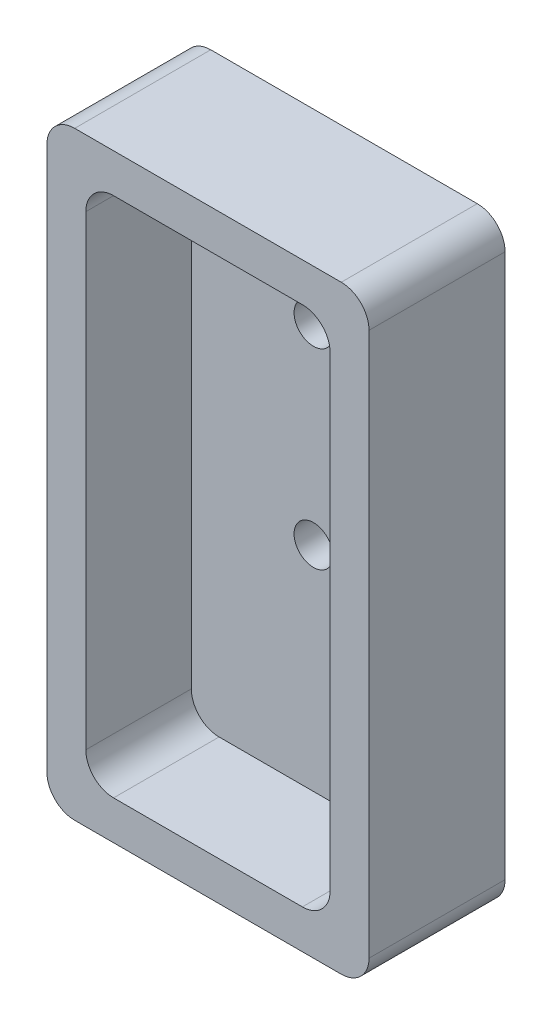
ISO-10303-21;
HEADER;
FILE_DESCRIPTION(('STEP AP214'),'2;1');
FILE_NAME('part.step','',(''),(''),'','','');
FILE_SCHEMA(('AUTOMOTIVE_DESIGN { 1 0 10303 214 1 1 1 1 }'));
ENDSEC;
DATA;
#1=APPLICATION_CONTEXT('core data for automotive mechanical design processes');
#2=APPLICATION_PROTOCOL_DEFINITION('international standard','automotive_design',2000,#1);
#3=PRODUCT_CONTEXT('',#1,'mechanical');
#4=PRODUCT('Part','Part','',(#3));
#5=PRODUCT_RELATED_PRODUCT_CATEGORY('part','',(#4));
#6=PRODUCT_DEFINITION_FORMATION('','',#4);
#7=PRODUCT_DEFINITION_CONTEXT('part definition',#1,'design');
#8=PRODUCT_DEFINITION('design','',#6,#7);
#9=PRODUCT_DEFINITION_SHAPE('','',#8);
#10=(LENGTH_UNIT() NAMED_UNIT(*) SI_UNIT(.MILLI.,.METRE.));
#11=(NAMED_UNIT(*) PLANE_ANGLE_UNIT() SI_UNIT($,.RADIAN.));
#12=(NAMED_UNIT(*) SI_UNIT($,.STERADIAN.) SOLID_ANGLE_UNIT());
#13=UNCERTAINTY_MEASURE_WITH_UNIT(LENGTH_MEASURE(1.E-05),#10,'distance_accuracy_value','');
#14=(GEOMETRIC_REPRESENTATION_CONTEXT(3) GLOBAL_UNCERTAINTY_ASSIGNED_CONTEXT((#13)) GLOBAL_UNIT_ASSIGNED_CONTEXT((#10,
#11,#12)) REPRESENTATION_CONTEXT('',''));
#15=CARTESIAN_POINT('',(0.,0.,0.));
#16=DIRECTION('',(0.,0.,1.));
#17=DIRECTION('',(1.,0.,0.));
#18=AXIS2_PLACEMENT_3D('',#15,#16,#17);
#19=CARTESIAN_POINT('',(-29.,107.92,-12.25));
#20=DIRECTION('',(1.,0.,0.));
#21=DIRECTION('',(0.,0.,-1.));
#22=AXIS2_PLACEMENT_3D('',#19,#20,#21);
#23=PLANE('',#22);
#24=DIRECTION('',(0.,-1.,0.));
#25=VECTOR('',#24,1.);
#26=CARTESIAN_POINT('',(-29.,107.92,-12.25));
#27=LINE('',#26,#25);
#28=CARTESIAN_POINT('',(-29.,102.92,-12.25));
#29=VERTEX_POINT('',#28);
#30=CARTESIAN_POINT('',(-29.,5.,-12.25));
#31=VERTEX_POINT('',#30);
#32=EDGE_CURVE('E171',#29,#31,#27,.T.);
#33=ORIENTED_EDGE('',*,*,#32,.T.);
#34=DIRECTION('',(0.,0.,1.));
#35=VECTOR('',#34,1.);
#36=CARTESIAN_POINT('',(-29.,5.,-12.25));
#37=LINE('',#36,#35);
#38=CARTESIAN_POINT('',(-29.,5.,12.25));
#39=VERTEX_POINT('',#38);
#40=EDGE_CURVE('E201',#31,#39,#37,.T.);
#41=ORIENTED_EDGE('',*,*,#40,.T.);
#42=DIRECTION('',(0.,-1.,0.));
#43=VECTOR('',#42,1.);
#44=CARTESIAN_POINT('',(-29.,107.92,12.25));
#45=LINE('',#44,#43);
#46=CARTESIAN_POINT('',(-29.,102.92,12.25));
#47=VERTEX_POINT('',#46);
#48=EDGE_CURVE('E176',#47,#39,#45,.T.);
#49=ORIENTED_EDGE('',*,*,#48,.F.);
#50=DIRECTION('',(0.,0.,1.));
#51=VECTOR('',#50,1.);
#52=CARTESIAN_POINT('',(-29.,102.92,-12.25));
#53=LINE('',#52,#51);
#54=EDGE_CURVE('E199',#47,#29,#53,.F.);
#55=ORIENTED_EDGE('',*,*,#54,.T.);
#56=EDGE_LOOP('',(#33,#41,#49,#55));
#57=FACE_BOUND('',#56,.T.);
#58=ADVANCED_FACE('F36',(#57),#23,.F.);
#59=CARTESIAN_POINT('',(-29.,107.92,12.25));
#60=DIRECTION('',(0.,0.,-1.));
#61=DIRECTION('',(-1.,0.,0.));
#62=AXIS2_PLACEMENT_3D('',#59,#60,#61);
#63=PLANE('',#62);
#64=DIRECTION('',(1.,0.,0.));
#65=VECTOR('',#64,1.);
#66=CARTESIAN_POINT('',(-22.,7.,12.25));
#67=LINE('',#66,#65);
#68=CARTESIAN_POINT('',(-17.,7.,12.25));
#69=VERTEX_POINT('',#68);
#70=CARTESIAN_POINT('',(17.,7.,12.25));
#71=VERTEX_POINT('',#70);
#72=EDGE_CURVE('E271',#69,#71,#67,.T.);
#73=ORIENTED_EDGE('',*,*,#72,.F.);
#74=CARTESIAN_POINT('',(-17.,12.,12.25));
#75=DIRECTION('',(0.,0.,-1.));
#76=DIRECTION('',(-1.,0.,0.));
#77=AXIS2_PLACEMENT_3D('',#74,#75,#76);
#78=CIRCLE('',#77,5.);
#79=CARTESIAN_POINT('',(-22.,12.,12.25));
#80=VERTEX_POINT('',#79);
#81=EDGE_CURVE('E238',#69,#80,#78,.T.);
#82=ORIENTED_EDGE('',*,*,#81,.T.);
#83=DIRECTION('',(0.,-1.,0.));
#84=VECTOR('',#83,1.);
#85=CARTESIAN_POINT('',(-22.,100.92,12.25));
#86=LINE('',#85,#84);
#87=CARTESIAN_POINT('',(-22.,95.92,12.25));
#88=VERTEX_POINT('',#87);
#89=EDGE_CURVE('E246',#88,#80,#86,.T.);
#90=ORIENTED_EDGE('',*,*,#89,.F.);
#91=CARTESIAN_POINT('',(-17.,95.92,12.25));
#92=DIRECTION('',(0.,0.,-1.));
#93=DIRECTION('',(-1.,0.,0.));
#94=AXIS2_PLACEMENT_3D('',#91,#92,#93);
#95=CIRCLE('',#94,5.);
#96=CARTESIAN_POINT('',(-17.,100.92,12.25));
#97=VERTEX_POINT('',#96);
#98=EDGE_CURVE('E11',#88,#97,#95,.T.);
#99=ORIENTED_EDGE('',*,*,#98,.T.);
#100=DIRECTION('',(-1.,0.,0.));
#101=VECTOR('',#100,1.);
#102=CARTESIAN_POINT('',(22.,100.92,12.25));
#103=LINE('',#102,#101);
#104=CARTESIAN_POINT('',(17.,100.92,12.25));
#105=VERTEX_POINT('',#104);
#106=EDGE_CURVE('E259',#105,#97,#103,.T.);
#107=ORIENTED_EDGE('',*,*,#106,.F.);
#108=CARTESIAN_POINT('',(17.,95.92,12.25));
#109=DIRECTION('',(0.,0.,-1.));
#110=DIRECTION('',(-1.,0.,0.));
#111=AXIS2_PLACEMENT_3D('',#108,#109,#110);
#112=CIRCLE('',#111,5.);
#113=CARTESIAN_POINT('',(22.,95.92,12.25));
#114=VERTEX_POINT('',#113);
#115=EDGE_CURVE('E45',#105,#114,#112,.T.);
#116=ORIENTED_EDGE('',*,*,#115,.T.);
#117=DIRECTION('',(0.,1.,0.));
#118=VECTOR('',#117,1.);
#119=CARTESIAN_POINT('',(22.,7.,12.25));
#120=LINE('',#119,#118);
#121=CARTESIAN_POINT('',(22.,12.,12.25));
#122=VERTEX_POINT('',#121);
#123=EDGE_CURVE('E274',#122,#114,#120,.T.);
#124=ORIENTED_EDGE('',*,*,#123,.F.);
#125=CARTESIAN_POINT('',(17.,12.,12.25));
#126=DIRECTION('',(0.,0.,-1.));
#127=DIRECTION('',(-1.,0.,0.));
#128=AXIS2_PLACEMENT_3D('',#125,#126,#127);
#129=CIRCLE('',#128,5.);
#130=EDGE_CURVE('E236',#122,#71,#129,.T.);
#131=ORIENTED_EDGE('',*,*,#130,.T.);
#132=EDGE_LOOP('',(#73,#82,#90,#99,#107,#116,#124,#131));
#133=FACE_BOUND('',#132,.T.);
#134=DIRECTION('',(1.,0.,0.));
#135=VECTOR('',#134,1.);
#136=CARTESIAN_POINT('',(-29.,0.,12.25));
#137=LINE('',#136,#135);
#138=CARTESIAN_POINT('',(-24.,0.,12.25));
#139=VERTEX_POINT('',#138);
#140=CARTESIAN_POINT('',(24.,0.,12.25));
#141=VERTEX_POINT('',#140);
#142=EDGE_CURVE('E268',#139,#141,#137,.T.);
#143=ORIENTED_EDGE('',*,*,#142,.T.);
#144=CARTESIAN_POINT('',(24.,5.,12.25));
#145=DIRECTION('',(0.,0.,-1.));
#146=DIRECTION('',(-1.,0.,0.));
#147=AXIS2_PLACEMENT_3D('',#144,#145,#146);
#148=CIRCLE('',#147,5.);
#149=CARTESIAN_POINT('',(29.,5.,12.25));
#150=VERTEX_POINT('',#149);
#151=EDGE_CURVE('E197',#141,#150,#148,.F.);
#152=ORIENTED_EDGE('',*,*,#151,.T.);
#153=DIRECTION('',(0.,-1.,0.));
#154=VECTOR('',#153,1.);
#155=CARTESIAN_POINT('',(29.,107.92,12.25));
#156=LINE('',#155,#154);
#157=CARTESIAN_POINT('',(29.,102.92,12.25));
#158=VERTEX_POINT('',#157);
#159=EDGE_CURVE('E170',#158,#150,#156,.T.);
#160=ORIENTED_EDGE('',*,*,#159,.F.);
#161=CARTESIAN_POINT('',(24.,102.92,12.25));
#162=DIRECTION('',(0.,0.,-1.));
#163=DIRECTION('',(-1.,0.,0.));
#164=AXIS2_PLACEMENT_3D('',#161,#162,#163);
#165=CIRCLE('',#164,5.);
#166=CARTESIAN_POINT('',(24.,107.92,12.25));
#167=VERTEX_POINT('',#166);
#168=EDGE_CURVE('E175',#158,#167,#165,.F.);
#169=ORIENTED_EDGE('',*,*,#168,.T.);
#170=DIRECTION('',(1.,0.,0.));
#171=VECTOR('',#170,1.);
#172=CARTESIAN_POINT('',(-29.,107.92,12.25));
#173=LINE('',#172,#171);
#174=CARTESIAN_POINT('',(-24.,107.92,12.25));
#175=VERTEX_POINT('',#174);
#176=EDGE_CURVE('E278',#175,#167,#173,.T.);
#177=ORIENTED_EDGE('',*,*,#176,.F.);
#178=CARTESIAN_POINT('',(-24.,102.92,12.25));
#179=DIRECTION('',(0.,0.,-1.));
#180=DIRECTION('',(-1.,0.,0.));
#181=AXIS2_PLACEMENT_3D('',#178,#179,#180);
#182=CIRCLE('',#181,5.);
#183=EDGE_CURVE('E193',#175,#47,#182,.F.);
#184=ORIENTED_EDGE('',*,*,#183,.T.);
#185=ORIENTED_EDGE('',*,*,#48,.T.);
#186=CARTESIAN_POINT('',(-24.,5.,12.25));
#187=DIRECTION('',(0.,0.,-1.));
#188=DIRECTION('',(-1.,0.,0.));
#189=AXIS2_PLACEMENT_3D('',#186,#187,#188);
#190=CIRCLE('',#189,5.);
#191=EDGE_CURVE('E195',#39,#139,#190,.F.);
#192=ORIENTED_EDGE('',*,*,#191,.T.);
#193=EDGE_LOOP('',(#143,#152,#160,#169,#177,#184,#185,#192));
#194=FACE_BOUND('',#193,.T.);
#195=ADVANCED_FACE('F313',(#133,#194),#63,.F.);
#196=CARTESIAN_POINT('',(29.,107.92,-12.25));
#197=DIRECTION('',(-1.,0.,0.));
#198=DIRECTION('',(0.,0.,1.));
#199=AXIS2_PLACEMENT_3D('',#196,#197,#198);
#200=PLANE('',#199);
#201=ORIENTED_EDGE('',*,*,#159,.T.);
#202=DIRECTION('',(0.,0.,-1.));
#203=VECTOR('',#202,1.);
#204=CARTESIAN_POINT('',(29.,5.,-12.25));
#205=LINE('',#204,#203);
#206=CARTESIAN_POINT('',(29.,5.,-12.25));
#207=VERTEX_POINT('',#206);
#208=EDGE_CURVE('E161',#150,#207,#205,.T.);
#209=ORIENTED_EDGE('',*,*,#208,.T.);
#210=DIRECTION('',(0.,-1.,0.));
#211=VECTOR('',#210,1.);
#212=CARTESIAN_POINT('',(29.,107.92,-12.25));
#213=LINE('',#212,#211);
#214=CARTESIAN_POINT('',(29.,102.92,-12.25));
#215=VERTEX_POINT('',#214);
#216=EDGE_CURVE('E153',#215,#207,#213,.T.);
#217=ORIENTED_EDGE('',*,*,#216,.F.);
#218=DIRECTION('',(0.,0.,-1.));
#219=VECTOR('',#218,1.);
#220=CARTESIAN_POINT('',(29.,102.92,12.25));
#221=LINE('',#220,#219);
#222=EDGE_CURVE('E167',#215,#158,#221,.F.);
#223=ORIENTED_EDGE('',*,*,#222,.T.);
#224=EDGE_LOOP('',(#201,#209,#217,#223));
#225=FACE_BOUND('',#224,.T.);
#226=ADVANCED_FACE('F166',(#225),#200,.F.);
#227=CARTESIAN_POINT('',(-29.,107.92,-12.25));
#228=DIRECTION('',(0.,0.,1.));
#229=DIRECTION('',(1.,0.,0.));
#230=AXIS2_PLACEMENT_3D('',#227,#228,#229);
#231=PLANE('',#230);
#232=CARTESIAN_POINT('',(0.,79.92,-12.25));
#233=DIRECTION('',(0.,0.,1.));
#234=DIRECTION('',(1.,0.,0.));
#235=AXIS2_PLACEMENT_3D('',#232,#233,#234);
#236=CIRCLE('',#235,3.50000000000001);
#237=CARTESIAN_POINT('',(3.50000000000001,79.92,-12.25));
#238=VERTEX_POINT('',#237);
#239=EDGE_CURVE('E242',#238,#238,#236,.T.);
#240=ORIENTED_EDGE('',*,*,#239,.T.);
#241=EDGE_LOOP('',(#240));
#242=FACE_BOUND('',#241,.T.);
#243=CARTESIAN_POINT('',(0.,45.4387,-12.25));
#244=DIRECTION('',(0.,0.,1.));
#245=DIRECTION('',(1.,0.,0.));
#246=AXIS2_PLACEMENT_3D('',#243,#244,#245);
#247=CIRCLE('',#246,3.5);
#248=CARTESIAN_POINT('',(3.5,45.4387,-12.25));
#249=VERTEX_POINT('',#248);
#250=EDGE_CURVE('E248',#249,#249,#247,.T.);
#251=ORIENTED_EDGE('',*,*,#250,.T.);
#252=EDGE_LOOP('',(#251));
#253=FACE_BOUND('',#252,.T.);
#254=ORIENTED_EDGE('',*,*,#216,.T.);
#255=CARTESIAN_POINT('',(24.,5.,-12.25));
#256=DIRECTION('',(0.,0.,1.));
#257=DIRECTION('',(1.,0.,0.));
#258=AXIS2_PLACEMENT_3D('',#255,#256,#257);
#259=CIRCLE('',#258,5.);
#260=CARTESIAN_POINT('',(24.,0.,-12.25));
#261=VERTEX_POINT('',#260);
#262=EDGE_CURVE('E186',#207,#261,#259,.F.);
#263=ORIENTED_EDGE('',*,*,#262,.T.);
#264=DIRECTION('',(-1.,0.,0.));
#265=VECTOR('',#264,1.);
#266=CARTESIAN_POINT('',(-29.,0.,-12.25));
#267=LINE('',#266,#265);
#268=CARTESIAN_POINT('',(-24.,0.,-12.25));
#269=VERTEX_POINT('',#268);
#270=EDGE_CURVE('E281',#261,#269,#267,.T.);
#271=ORIENTED_EDGE('',*,*,#270,.T.);
#272=CARTESIAN_POINT('',(-24.,5.,-12.25));
#273=DIRECTION('',(0.,0.,1.));
#274=DIRECTION('',(1.,0.,0.));
#275=AXIS2_PLACEMENT_3D('',#272,#273,#274);
#276=CIRCLE('',#275,5.);
#277=EDGE_CURVE('E184',#269,#31,#276,.F.);
#278=ORIENTED_EDGE('',*,*,#277,.T.);
#279=ORIENTED_EDGE('',*,*,#32,.F.);
#280=CARTESIAN_POINT('',(-24.,102.92,-12.25));
#281=DIRECTION('',(0.,0.,1.));
#282=DIRECTION('',(1.,0.,0.));
#283=AXIS2_PLACEMENT_3D('',#280,#281,#282);
#284=CIRCLE('',#283,5.);
#285=CARTESIAN_POINT('',(-24.,107.92,-12.25));
#286=VERTEX_POINT('',#285);
#287=EDGE_CURVE('E160',#29,#286,#284,.F.);
#288=ORIENTED_EDGE('',*,*,#287,.T.);
#289=DIRECTION('',(-1.,0.,0.));
#290=VECTOR('',#289,1.);
#291=CARTESIAN_POINT('',(-29.,107.92,-12.25));
#292=LINE('',#291,#290);
#293=CARTESIAN_POINT('',(24.,107.92,-12.25));
#294=VERTEX_POINT('',#293);
#295=EDGE_CURVE('E155',#294,#286,#292,.T.);
#296=ORIENTED_EDGE('',*,*,#295,.F.);
#297=CARTESIAN_POINT('',(24.,102.92,-12.25));
#298=DIRECTION('',(0.,0.,1.));
#299=DIRECTION('',(1.,0.,0.));
#300=AXIS2_PLACEMENT_3D('',#297,#298,#299);
#301=CIRCLE('',#300,5.);
#302=EDGE_CURVE('E150',#294,#215,#301,.F.);
#303=ORIENTED_EDGE('',*,*,#302,.T.);
#304=EDGE_LOOP('',(#254,#263,#271,#278,#279,#288,#296,#303));
#305=FACE_BOUND('',#304,.T.);
#306=ADVANCED_FACE('F152',(#242,#253,#305),#231,.F.);
#307=CARTESIAN_POINT('',(0.,107.92,0.));
#308=DIRECTION('',(0.,1.,0.));
#309=DIRECTION('',(0.,0.,1.));
#310=AXIS2_PLACEMENT_3D('',#307,#308,#309);
#311=PLANE('',#310);
#312=ORIENTED_EDGE('',*,*,#295,.T.);
#313=DIRECTION('',(0.,0.,1.));
#314=VECTOR('',#313,1.);
#315=CARTESIAN_POINT('',(-24.,107.92,12.25));
#316=LINE('',#315,#314);
#317=EDGE_CURVE('E206',#286,#175,#316,.T.);
#318=ORIENTED_EDGE('',*,*,#317,.T.);
#319=ORIENTED_EDGE('',*,*,#176,.T.);
#320=DIRECTION('',(0.,0.,-1.));
#321=VECTOR('',#320,1.);
#322=CARTESIAN_POINT('',(24.,107.92,-12.25));
#323=LINE('',#322,#321);
#324=EDGE_CURVE('E204',#167,#294,#323,.T.);
#325=ORIENTED_EDGE('',*,*,#324,.T.);
#326=EDGE_LOOP('',(#312,#318,#319,#325));
#327=FACE_BOUND('',#326,.T.);
#328=ADVANCED_FACE('F311',(#327),#311,.T.);
#329=CARTESIAN_POINT('',(0.,0.,0.));
#330=DIRECTION('',(0.,1.,0.));
#331=DIRECTION('',(0.,0.,1.));
#332=AXIS2_PLACEMENT_3D('',#329,#330,#331);
#333=PLANE('',#332);
#334=ORIENTED_EDGE('',*,*,#270,.F.);
#335=DIRECTION('',(0.,0.,-1.));
#336=VECTOR('',#335,1.);
#337=CARTESIAN_POINT('',(24.,0.,0.));
#338=LINE('',#337,#336);
#339=EDGE_CURVE('E190',#261,#141,#338,.F.);
#340=ORIENTED_EDGE('',*,*,#339,.T.);
#341=ORIENTED_EDGE('',*,*,#142,.F.);
#342=DIRECTION('',(0.,0.,1.));
#343=VECTOR('',#342,1.);
#344=CARTESIAN_POINT('',(-24.,0.,0.));
#345=LINE('',#344,#343);
#346=EDGE_CURVE('E188',#139,#269,#345,.F.);
#347=ORIENTED_EDGE('',*,*,#346,.T.);
#348=EDGE_LOOP('',(#334,#340,#341,#347));
#349=FACE_BOUND('',#348,.T.);
#350=ADVANCED_FACE('F296',(#349),#333,.F.);
#351=CARTESIAN_POINT('',(24.,5.,-12.25));
#352=DIRECTION('',(0.,0.,-1.));
#353=DIRECTION('',(-1.,0.,0.));
#354=AXIS2_PLACEMENT_3D('',#351,#352,#353);
#355=CYLINDRICAL_SURFACE('',#354,5.);
#356=ORIENTED_EDGE('',*,*,#151,.F.);
#357=ORIENTED_EDGE('',*,*,#339,.F.);
#358=ORIENTED_EDGE('',*,*,#262,.F.);
#359=ORIENTED_EDGE('',*,*,#208,.F.);
#360=EDGE_LOOP('',(#356,#357,#358,#359));
#361=FACE_BOUND('',#360,.T.);
#362=ADVANCED_FACE('F291',(#361),#355,.T.);
#363=CARTESIAN_POINT('',(-24.,5.,-12.25));
#364=DIRECTION('',(0.,0.,1.));
#365=DIRECTION('',(1.,0.,0.));
#366=AXIS2_PLACEMENT_3D('',#363,#364,#365);
#367=CYLINDRICAL_SURFACE('',#366,5.);
#368=ORIENTED_EDGE('',*,*,#277,.F.);
#369=ORIENTED_EDGE('',*,*,#346,.F.);
#370=ORIENTED_EDGE('',*,*,#191,.F.);
#371=ORIENTED_EDGE('',*,*,#40,.F.);
#372=EDGE_LOOP('',(#368,#369,#370,#371));
#373=FACE_BOUND('',#372,.T.);
#374=ADVANCED_FACE('F300',(#373),#367,.T.);
#375=CARTESIAN_POINT('',(-24.,102.92,0.));
#376=DIRECTION('',(0.,0.,-1.));
#377=DIRECTION('',(-1.,0.,0.));
#378=AXIS2_PLACEMENT_3D('',#375,#376,#377);
#379=CYLINDRICAL_SURFACE('',#378,5.);
#380=ORIENTED_EDGE('',*,*,#287,.F.);
#381=ORIENTED_EDGE('',*,*,#54,.F.);
#382=ORIENTED_EDGE('',*,*,#183,.F.);
#383=ORIENTED_EDGE('',*,*,#317,.F.);
#384=EDGE_LOOP('',(#380,#381,#382,#383));
#385=FACE_BOUND('',#384,.T.);
#386=ADVANCED_FACE('F308',(#385),#379,.T.);
#387=CARTESIAN_POINT('',(24.,102.92,0.));
#388=DIRECTION('',(0.,0.,1.));
#389=DIRECTION('',(1.,0.,0.));
#390=AXIS2_PLACEMENT_3D('',#387,#388,#389);
#391=CYLINDRICAL_SURFACE('',#390,5.);
#392=ORIENTED_EDGE('',*,*,#168,.F.);
#393=ORIENTED_EDGE('',*,*,#222,.F.);
#394=ORIENTED_EDGE('',*,*,#302,.F.);
#395=ORIENTED_EDGE('',*,*,#324,.F.);
#396=EDGE_LOOP('',(#392,#393,#394,#395));
#397=FACE_BOUND('',#396,.T.);
#398=ADVANCED_FACE('F174',(#397),#391,.T.);
#399=CARTESIAN_POINT('',(-22.,100.92,-6.75));
#400=DIRECTION('',(-1.,0.,0.));
#401=DIRECTION('',(0.,0.,1.));
#402=AXIS2_PLACEMENT_3D('',#399,#400,#401);
#403=PLANE('',#402);
#404=ORIENTED_EDGE('',*,*,#89,.T.);
#405=DIRECTION('',(0.,0.,1.));
#406=VECTOR('',#405,1.);
#407=CARTESIAN_POINT('',(-22.,12.,-6.75));
#408=LINE('',#407,#406);
#409=CARTESIAN_POINT('',(-22.,12.,-6.75));
#410=VERTEX_POINT('',#409);
#411=EDGE_CURVE('E230',#80,#410,#408,.F.);
#412=ORIENTED_EDGE('',*,*,#411,.T.);
#413=DIRECTION('',(0.,-1.,0.));
#414=VECTOR('',#413,1.);
#415=CARTESIAN_POINT('',(-22.,100.92,-6.75));
#416=LINE('',#415,#414);
#417=CARTESIAN_POINT('',(-22.,95.92,-6.75));
#418=VERTEX_POINT('',#417);
#419=EDGE_CURVE('E255',#418,#410,#416,.T.);
#420=ORIENTED_EDGE('',*,*,#419,.F.);
#421=DIRECTION('',(0.,0.,1.));
#422=VECTOR('',#421,1.);
#423=CARTESIAN_POINT('',(-22.,95.92,12.25));
#424=LINE('',#423,#422);
#425=EDGE_CURVE('E227',#418,#88,#424,.T.);
#426=ORIENTED_EDGE('',*,*,#425,.T.);
#427=EDGE_LOOP('',(#404,#412,#420,#426));
#428=FACE_BOUND('',#427,.T.);
#429=ADVANCED_FACE('F333',(#428),#403,.F.);
#430=CARTESIAN_POINT('',(22.,100.92,-6.75));
#431=DIRECTION('',(0.,1.,0.));
#432=DIRECTION('',(0.,0.,1.));
#433=AXIS2_PLACEMENT_3D('',#430,#431,#432);
#434=PLANE('',#433);
#435=DIRECTION('',(-1.,0.,0.));
#436=VECTOR('',#435,1.);
#437=CARTESIAN_POINT('',(22.,100.92,-6.75));
#438=LINE('',#437,#436);
#439=CARTESIAN_POINT('',(17.,100.92,-6.75));
#440=VERTEX_POINT('',#439);
#441=CARTESIAN_POINT('',(-17.,100.92,-6.75));
#442=VERTEX_POINT('',#441);
#443=EDGE_CURVE('E265',#440,#442,#438,.T.);
#444=ORIENTED_EDGE('',*,*,#443,.F.);
#445=DIRECTION('',(0.,0.,1.));
#446=VECTOR('',#445,1.);
#447=CARTESIAN_POINT('',(17.,100.92,12.25));
#448=LINE('',#447,#446);
#449=EDGE_CURVE('E234',#440,#105,#448,.T.);
#450=ORIENTED_EDGE('',*,*,#449,.T.);
#451=ORIENTED_EDGE('',*,*,#106,.T.);
#452=DIRECTION('',(0.,0.,1.));
#453=VECTOR('',#452,1.);
#454=CARTESIAN_POINT('',(-17.,100.92,-6.75));
#455=LINE('',#454,#453);
#456=EDGE_CURVE('E232',#97,#442,#455,.F.);
#457=ORIENTED_EDGE('',*,*,#456,.T.);
#458=EDGE_LOOP('',(#444,#450,#451,#457));
#459=FACE_BOUND('',#458,.T.);
#460=ADVANCED_FACE('F355',(#459),#434,.F.);
#461=CARTESIAN_POINT('',(22.,7.,-6.75));
#462=DIRECTION('',(1.,0.,0.));
#463=DIRECTION('',(0.,0.,-1.));
#464=AXIS2_PLACEMENT_3D('',#461,#462,#463);
#465=PLANE('',#464);
#466=DIRECTION('',(0.,1.,0.));
#467=VECTOR('',#466,1.);
#468=CARTESIAN_POINT('',(22.,7.,-6.75));
#469=LINE('',#468,#467);
#470=CARTESIAN_POINT('',(22.,12.,-6.75));
#471=VERTEX_POINT('',#470);
#472=CARTESIAN_POINT('',(22.,95.92,-6.75));
#473=VERTEX_POINT('',#472);
#474=EDGE_CURVE('E262',#471,#473,#469,.T.);
#475=ORIENTED_EDGE('',*,*,#474,.F.);
#476=DIRECTION('',(0.,0.,1.));
#477=VECTOR('',#476,1.);
#478=CARTESIAN_POINT('',(22.,12.,12.25));
#479=LINE('',#478,#477);
#480=EDGE_CURVE('E211',#471,#122,#479,.T.);
#481=ORIENTED_EDGE('',*,*,#480,.T.);
#482=ORIENTED_EDGE('',*,*,#123,.T.);
#483=DIRECTION('',(0.,0.,1.));
#484=VECTOR('',#483,1.);
#485=CARTESIAN_POINT('',(22.,95.92,-6.75));
#486=LINE('',#485,#484);
#487=EDGE_CURVE('E209',#114,#473,#486,.F.);
#488=ORIENTED_EDGE('',*,*,#487,.T.);
#489=EDGE_LOOP('',(#475,#481,#482,#488));
#490=FACE_BOUND('',#489,.T.);
#491=ADVANCED_FACE('F370',(#490),#465,.F.);
#492=CARTESIAN_POINT('',(-22.,7.,-6.75));
#493=DIRECTION('',(0.,-1.,0.));
#494=DIRECTION('',(0.,0.,-1.));
#495=AXIS2_PLACEMENT_3D('',#492,#493,#494);
#496=PLANE('',#495);
#497=ORIENTED_EDGE('',*,*,#72,.T.);
#498=DIRECTION('',(0.,0.,1.));
#499=VECTOR('',#498,1.);
#500=CARTESIAN_POINT('',(17.,7.,-6.75));
#501=LINE('',#500,#499);
#502=CARTESIAN_POINT('',(17.,7.,-6.75));
#503=VERTEX_POINT('',#502);
#504=EDGE_CURVE('E217',#71,#503,#501,.F.);
#505=ORIENTED_EDGE('',*,*,#504,.T.);
#506=DIRECTION('',(1.,0.,0.));
#507=VECTOR('',#506,1.);
#508=CARTESIAN_POINT('',(-22.,7.,-6.75));
#509=LINE('',#508,#507);
#510=CARTESIAN_POINT('',(-17.,7.,-6.75));
#511=VERTEX_POINT('',#510);
#512=EDGE_CURVE('E258',#511,#503,#509,.T.);
#513=ORIENTED_EDGE('',*,*,#512,.F.);
#514=DIRECTION('',(0.,0.,1.));
#515=VECTOR('',#514,1.);
#516=CARTESIAN_POINT('',(-17.,7.,12.25));
#517=LINE('',#516,#515);
#518=EDGE_CURVE('E214',#511,#69,#517,.T.);
#519=ORIENTED_EDGE('',*,*,#518,.T.);
#520=EDGE_LOOP('',(#497,#505,#513,#519));
#521=FACE_BOUND('',#520,.T.);
#522=ADVANCED_FACE('F366',(#521),#496,.F.);
#523=CARTESIAN_POINT('',(0.,0.,-6.75));
#524=DIRECTION('',(0.,0.,1.));
#525=DIRECTION('',(1.,0.,0.));
#526=AXIS2_PLACEMENT_3D('',#523,#524,#525);
#527=PLANE('',#526);
#528=CARTESIAN_POINT('',(0.,79.92,-6.75));
#529=DIRECTION('',(0.,0.,1.));
#530=DIRECTION('',(1.,0.,0.));
#531=AXIS2_PLACEMENT_3D('',#528,#529,#530);
#532=CIRCLE('',#531,3.50000000000001);
#533=CARTESIAN_POINT('',(3.50000000000001,79.92,-6.75));
#534=VERTEX_POINT('',#533);
#535=EDGE_CURVE('E40',#534,#534,#532,.T.);
#536=ORIENTED_EDGE('',*,*,#535,.F.);
#537=EDGE_LOOP('',(#536));
#538=FACE_BOUND('',#537,.T.);
#539=CARTESIAN_POINT('',(0.,45.4387,-6.75));
#540=DIRECTION('',(0.,0.,1.));
#541=DIRECTION('',(1.,0.,0.));
#542=AXIS2_PLACEMENT_3D('',#539,#540,#541);
#543=CIRCLE('',#542,3.5);
#544=CARTESIAN_POINT('',(3.5,45.4387,-6.75));
#545=VERTEX_POINT('',#544);
#546=EDGE_CURVE('E240',#545,#545,#543,.T.);
#547=ORIENTED_EDGE('',*,*,#546,.F.);
#548=EDGE_LOOP('',(#547));
#549=FACE_BOUND('',#548,.T.);
#550=ORIENTED_EDGE('',*,*,#512,.T.);
#551=CARTESIAN_POINT('',(17.,12.,-6.75));
#552=DIRECTION('',(0.,0.,1.));
#553=DIRECTION('',(1.,0.,0.));
#554=AXIS2_PLACEMENT_3D('',#551,#552,#553);
#555=CIRCLE('',#554,5.);
#556=EDGE_CURVE('E225',#503,#471,#555,.T.);
#557=ORIENTED_EDGE('',*,*,#556,.T.);
#558=ORIENTED_EDGE('',*,*,#474,.T.);
#559=CARTESIAN_POINT('',(17.,95.92,-6.75));
#560=DIRECTION('',(0.,0.,1.));
#561=DIRECTION('',(1.,0.,0.));
#562=AXIS2_PLACEMENT_3D('',#559,#560,#561);
#563=CIRCLE('',#562,5.);
#564=EDGE_CURVE('E221',#473,#440,#563,.T.);
#565=ORIENTED_EDGE('',*,*,#564,.T.);
#566=ORIENTED_EDGE('',*,*,#443,.T.);
#567=CARTESIAN_POINT('',(-17.,95.92,-6.75));
#568=DIRECTION('',(0.,0.,1.));
#569=DIRECTION('',(1.,0.,0.));
#570=AXIS2_PLACEMENT_3D('',#567,#568,#569);
#571=CIRCLE('',#570,5.);
#572=EDGE_CURVE('E219',#442,#418,#571,.T.);
#573=ORIENTED_EDGE('',*,*,#572,.T.);
#574=ORIENTED_EDGE('',*,*,#419,.T.);
#575=CARTESIAN_POINT('',(-17.,12.,-6.75));
#576=DIRECTION('',(0.,0.,1.));
#577=DIRECTION('',(1.,0.,0.));
#578=AXIS2_PLACEMENT_3D('',#575,#576,#577);
#579=CIRCLE('',#578,5.);
#580=EDGE_CURVE('E223',#410,#511,#579,.T.);
#581=ORIENTED_EDGE('',*,*,#580,.T.);
#582=EDGE_LOOP('',(#550,#557,#558,#565,#566,#573,#574,#581));
#583=FACE_BOUND('',#582,.T.);
#584=ADVANCED_FACE('F338',(#538,#549,#583),#527,.T.);
#585=CARTESIAN_POINT('',(17.,12.,-6.75));
#586=DIRECTION('',(0.,0.,-1.));
#587=DIRECTION('',(-1.,0.,0.));
#588=AXIS2_PLACEMENT_3D('',#585,#586,#587);
#589=CYLINDRICAL_SURFACE('',#588,5.);
#590=ORIENTED_EDGE('',*,*,#556,.F.);
#591=ORIENTED_EDGE('',*,*,#504,.F.);
#592=ORIENTED_EDGE('',*,*,#130,.F.);
#593=ORIENTED_EDGE('',*,*,#480,.F.);
#594=EDGE_LOOP('',(#590,#591,#592,#593));
#595=FACE_BOUND('',#594,.T.);
#596=ADVANCED_FACE('F334',(#595),#589,.F.);
#597=CARTESIAN_POINT('',(-17.,12.,-6.75));
#598=DIRECTION('',(0.,0.,-1.));
#599=DIRECTION('',(-1.,0.,0.));
#600=AXIS2_PLACEMENT_3D('',#597,#598,#599);
#601=CYLINDRICAL_SURFACE('',#600,5.);
#602=ORIENTED_EDGE('',*,*,#580,.F.);
#603=ORIENTED_EDGE('',*,*,#411,.F.);
#604=ORIENTED_EDGE('',*,*,#81,.F.);
#605=ORIENTED_EDGE('',*,*,#518,.F.);
#606=EDGE_LOOP('',(#602,#603,#604,#605));
#607=FACE_BOUND('',#606,.T.);
#608=ADVANCED_FACE('F337',(#607),#601,.F.);
#609=CARTESIAN_POINT('',(17.,95.92,-6.75));
#610=DIRECTION('',(0.,0.,-1.));
#611=DIRECTION('',(-1.,0.,0.));
#612=AXIS2_PLACEMENT_3D('',#609,#610,#611);
#613=CYLINDRICAL_SURFACE('',#612,5.);
#614=ORIENTED_EDGE('',*,*,#564,.F.);
#615=ORIENTED_EDGE('',*,*,#487,.F.);
#616=ORIENTED_EDGE('',*,*,#115,.F.);
#617=ORIENTED_EDGE('',*,*,#449,.F.);
#618=EDGE_LOOP('',(#614,#615,#616,#617));
#619=FACE_BOUND('',#618,.T.);
#620=ADVANCED_FACE('F341',(#619),#613,.F.);
#621=CARTESIAN_POINT('',(-17.,95.92,-6.75));
#622=DIRECTION('',(0.,0.,-1.));
#623=DIRECTION('',(-1.,0.,0.));
#624=AXIS2_PLACEMENT_3D('',#621,#622,#623);
#625=CYLINDRICAL_SURFACE('',#624,5.);
#626=ORIENTED_EDGE('',*,*,#572,.F.);
#627=ORIENTED_EDGE('',*,*,#456,.F.);
#628=ORIENTED_EDGE('',*,*,#98,.F.);
#629=ORIENTED_EDGE('',*,*,#425,.F.);
#630=EDGE_LOOP('',(#626,#627,#628,#629));
#631=FACE_BOUND('',#630,.T.);
#632=ADVANCED_FACE('F38',(#631),#625,.F.);
#633=CARTESIAN_POINT('',(0.,45.4387,-12.25));
#634=DIRECTION('',(0.,0.,1.));
#635=DIRECTION('',(1.,0.,0.));
#636=AXIS2_PLACEMENT_3D('',#633,#634,#635);
#637=CYLINDRICAL_SURFACE('',#636,3.5);
#638=ORIENTED_EDGE('',*,*,#546,.T.);
#639=EDGE_LOOP('',(#638));
#640=FACE_BOUND('',#639,.T.);
#641=ORIENTED_EDGE('',*,*,#250,.F.);
#642=EDGE_LOOP('',(#641));
#643=FACE_BOUND('',#642,.T.);
#644=ADVANCED_FACE('F347',(#640,#643),#637,.F.);
#645=CARTESIAN_POINT('',(0.,79.92,-12.25));
#646=DIRECTION('',(0.,0.,1.));
#647=DIRECTION('',(1.,0.,0.));
#648=AXIS2_PLACEMENT_3D('',#645,#646,#647);
#649=CYLINDRICAL_SURFACE('',#648,3.50000000000001);
#650=ORIENTED_EDGE('',*,*,#535,.T.);
#651=EDGE_LOOP('',(#650));
#652=FACE_BOUND('',#651,.T.);
#653=ORIENTED_EDGE('',*,*,#239,.F.);
#654=EDGE_LOOP('',(#653));
#655=FACE_BOUND('',#654,.T.);
#656=ADVANCED_FACE('F394',(#652,#655),#649,.F.);
#657=CLOSED_SHELL('',(#58,#195,#226,#306,#328,#350,#362,#374,#386,#398,#429,#460,#491,#522,#584,
#596,#608,#620,#632,#644,#656));
#658=MANIFOLD_SOLID_BREP('B2',#657);
#659=ADVANCED_BREP_SHAPE_REPRESENTATION('',(#18,#658),#14);
#660=SHAPE_DEFINITION_REPRESENTATION(#9,#659);
ENDSEC;
END-ISO-10303-21;
